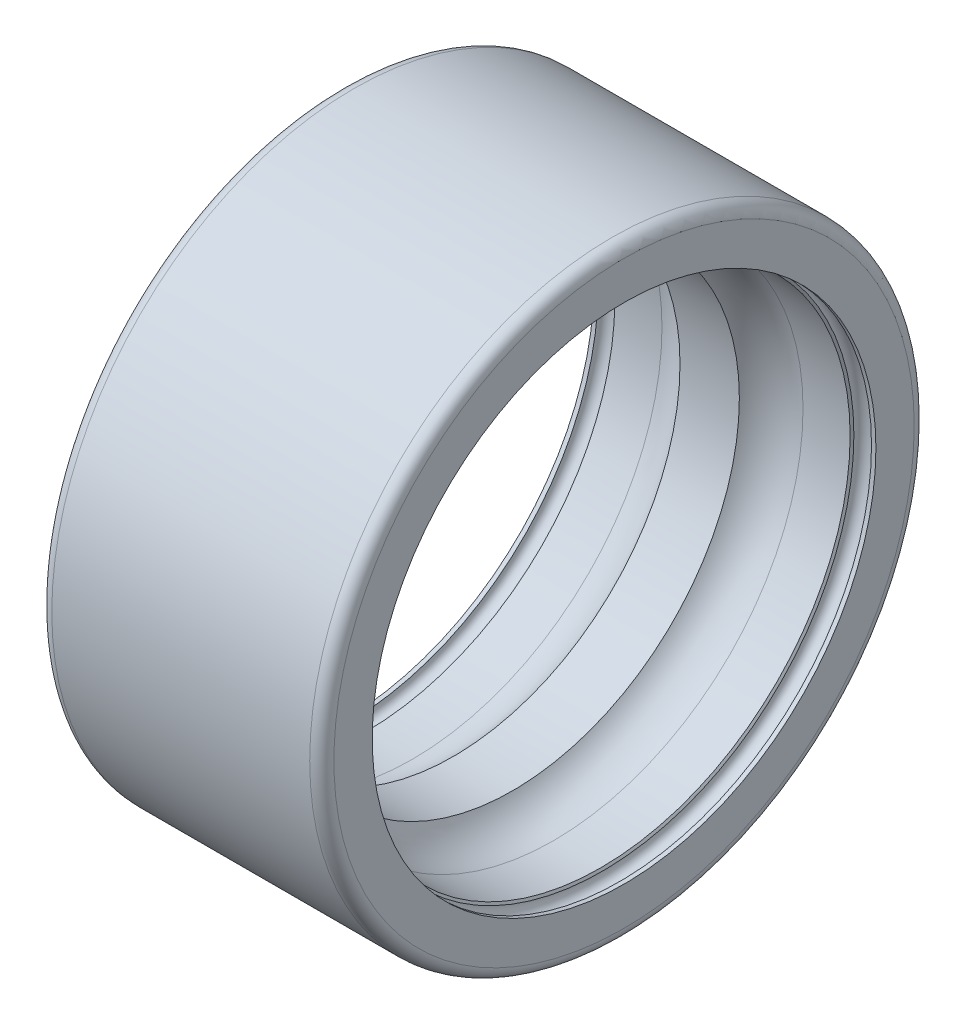
ISO-10303-21;
HEADER;
FILE_DESCRIPTION(('STEP AP214'),'2;1');
FILE_NAME('part.step','',(''),(''),'','','');
FILE_SCHEMA(('AUTOMOTIVE_DESIGN { 1 0 10303 214 1 1 1 1 }'));
ENDSEC;
DATA;
#1=APPLICATION_CONTEXT('core data for automotive mechanical design processes');
#2=APPLICATION_PROTOCOL_DEFINITION('international standard','automotive_design',2000,#1);
#3=PRODUCT_CONTEXT('',#1,'mechanical');
#4=PRODUCT('Part','Part','',(#3));
#5=PRODUCT_RELATED_PRODUCT_CATEGORY('part','',(#4));
#6=PRODUCT_DEFINITION_FORMATION('','',#4);
#7=PRODUCT_DEFINITION_CONTEXT('part definition',#1,'design');
#8=PRODUCT_DEFINITION('design','',#6,#7);
#9=PRODUCT_DEFINITION_SHAPE('','',#8);
#10=(LENGTH_UNIT() NAMED_UNIT(*) SI_UNIT(.MILLI.,.METRE.));
#11=(NAMED_UNIT(*) PLANE_ANGLE_UNIT() SI_UNIT($,.RADIAN.));
#12=(NAMED_UNIT(*) SI_UNIT($,.STERADIAN.) SOLID_ANGLE_UNIT());
#13=UNCERTAINTY_MEASURE_WITH_UNIT(LENGTH_MEASURE(1.E-05),#10,'distance_accuracy_value','');
#14=(GEOMETRIC_REPRESENTATION_CONTEXT(3) GLOBAL_UNCERTAINTY_ASSIGNED_CONTEXT((#13)) GLOBAL_UNIT_ASSIGNED_CONTEXT((#10,
#11,#12)) REPRESENTATION_CONTEXT('',''));
#15=CARTESIAN_POINT('',(0.,0.,0.));
#16=DIRECTION('',(0.,0.,1.));
#17=DIRECTION('',(1.,0.,0.));
#18=AXIS2_PLACEMENT_3D('',#15,#16,#17);
#19=CARTESIAN_POINT('',(0.,0.,-14.4));
#20=DIRECTION('',(-1.,0.,0.));
#21=DIRECTION('',(0.,0.,1.));
#22=AXIS2_PLACEMENT_3D('',#19,#20,#21);
#23=PLANE('',#22);
#24=CARTESIAN_POINT('',(0.,0.,0.));
#25=DIRECTION('',(1.,0.,0.));
#26=DIRECTION('',(0.,0.,-1.));
#27=AXIS2_PLACEMENT_3D('',#24,#25,#26);
#28=CIRCLE('',#27,12.5);
#29=CARTESIAN_POINT('',(0.,0.,-12.5));
#30=VERTEX_POINT('',#29);
#31=EDGE_CURVE('E81',#30,#30,#28,.T.);
#32=ORIENTED_EDGE('',*,*,#31,.T.);
#33=EDGE_LOOP('',(#32));
#34=FACE_BOUND('',#33,.T.);
#35=CARTESIAN_POINT('',(0.,0.,0.));
#36=DIRECTION('',(1.,0.,0.));
#37=DIRECTION('',(0.,0.,-1.));
#38=AXIS2_PLACEMENT_3D('',#35,#36,#37);
#39=CIRCLE('',#38,14.4);
#40=CARTESIAN_POINT('',(0.,0.,-14.4));
#41=VERTEX_POINT('',#40);
#42=EDGE_CURVE('E10',#41,#41,#39,.T.);
#43=ORIENTED_EDGE('',*,*,#42,.F.);
#44=EDGE_LOOP('',(#43));
#45=FACE_BOUND('',#44,.T.);
#46=ADVANCED_FACE('F29',(#34,#45),#23,.T.);
#47=CARTESIAN_POINT('',(0.599999999999874,0.,0.));
#48=DIRECTION('',(1.,0.,0.));
#49=DIRECTION('',(0.,0.,-1.));
#50=AXIS2_PLACEMENT_3D('',#47,#48,#49);
#51=TOROIDAL_SURFACE('',#50,14.4000000000001,0.599999999999874);
#52=ORIENTED_EDGE('',*,*,#42,.T.);
#53=EDGE_LOOP('',(#52));
#54=FACE_BOUND('',#53,.T.);
#55=CARTESIAN_POINT('',(0.6,0.,0.));
#56=DIRECTION('',(1.,0.,0.));
#57=DIRECTION('',(0.,0.,-1.));
#58=AXIS2_PLACEMENT_3D('',#55,#56,#57);
#59=CIRCLE('',#58,15.);
#60=CARTESIAN_POINT('',(0.6,0.,-15.));
#61=VERTEX_POINT('',#60);
#62=EDGE_CURVE('E35',#61,#61,#59,.T.);
#63=ORIENTED_EDGE('',*,*,#62,.F.);
#64=EDGE_LOOP('',(#63));
#65=FACE_BOUND('',#64,.T.);
#66=ADVANCED_FACE('F99',(#54,#65),#51,.T.);
#67=CARTESIAN_POINT('',(14.,0.,0.));
#68=DIRECTION('',(1.,0.,0.));
#69=DIRECTION('',(0.,0.,-1.));
#70=AXIS2_PLACEMENT_3D('',#67,#68,#69);
#71=CYLINDRICAL_SURFACE('',#70,15.);
#72=ORIENTED_EDGE('',*,*,#62,.T.);
#73=EDGE_LOOP('',(#72));
#74=FACE_BOUND('',#73,.T.);
#75=CARTESIAN_POINT('',(13.4,0.,0.));
#76=DIRECTION('',(1.,0.,0.));
#77=DIRECTION('',(0.,0.,-1.));
#78=AXIS2_PLACEMENT_3D('',#75,#76,#77);
#79=CIRCLE('',#78,15.);
#80=CARTESIAN_POINT('',(13.4,0.,-15.));
#81=VERTEX_POINT('',#80);
#82=EDGE_CURVE('E39',#81,#81,#79,.T.);
#83=ORIENTED_EDGE('',*,*,#82,.F.);
#84=EDGE_LOOP('',(#83));
#85=FACE_BOUND('',#84,.T.);
#86=ADVANCED_FACE('F103',(#74,#85),#71,.T.);
#87=CARTESIAN_POINT('',(13.4000000000002,0.,0.));
#88=DIRECTION('',(1.,0.,0.));
#89=DIRECTION('',(0.,0.,-1.));
#90=AXIS2_PLACEMENT_3D('',#87,#88,#89);
#91=TOROIDAL_SURFACE('',#90,14.4000000000002,0.599999999999755);
#92=ORIENTED_EDGE('',*,*,#82,.T.);
#93=EDGE_LOOP('',(#92));
#94=FACE_BOUND('',#93,.T.);
#95=CARTESIAN_POINT('',(14.,0.,0.));
#96=DIRECTION('',(1.,0.,0.));
#97=DIRECTION('',(0.,0.,-1.));
#98=AXIS2_PLACEMENT_3D('',#95,#96,#97);
#99=CIRCLE('',#98,14.4);
#100=CARTESIAN_POINT('',(14.,0.,-14.4));
#101=VERTEX_POINT('',#100);
#102=EDGE_CURVE('E43',#101,#101,#99,.T.);
#103=ORIENTED_EDGE('',*,*,#102,.F.);
#104=EDGE_LOOP('',(#103));
#105=FACE_BOUND('',#104,.T.);
#106=ADVANCED_FACE('F107',(#94,#105),#91,.T.);
#107=CARTESIAN_POINT('',(14.,0.,-12.5));
#108=DIRECTION('',(1.,0.,0.));
#109=DIRECTION('',(0.,0.,-1.));
#110=AXIS2_PLACEMENT_3D('',#107,#108,#109);
#111=PLANE('',#110);
#112=ORIENTED_EDGE('',*,*,#102,.T.);
#113=EDGE_LOOP('',(#112));
#114=FACE_BOUND('',#113,.T.);
#115=CARTESIAN_POINT('',(14.,0.,0.));
#116=DIRECTION('',(1.,0.,0.));
#117=DIRECTION('',(0.,0.,-1.));
#118=AXIS2_PLACEMENT_3D('',#115,#116,#117);
#119=CIRCLE('',#118,12.5);
#120=CARTESIAN_POINT('',(14.,0.,-12.5));
#121=VERTEX_POINT('',#120);
#122=EDGE_CURVE('E48',#121,#121,#119,.T.);
#123=ORIENTED_EDGE('',*,*,#122,.F.);
#124=EDGE_LOOP('',(#123));
#125=FACE_BOUND('',#124,.T.);
#126=ADVANCED_FACE('F113',(#114,#125),#111,.T.);
#127=CARTESIAN_POINT('',(14.,0.,0.));
#128=DIRECTION('',(1.,0.,0.));
#129=DIRECTION('',(0.,0.,-1.));
#130=AXIS2_PLACEMENT_3D('',#127,#128,#129);
#131=CYLINDRICAL_SURFACE('',#130,12.5);
#132=ORIENTED_EDGE('',*,*,#122,.T.);
#133=EDGE_LOOP('',(#132));
#134=FACE_BOUND('',#133,.T.);
#135=CARTESIAN_POINT('',(13.78125,0.,0.));
#136=DIRECTION('',(1.,0.,0.));
#137=DIRECTION('',(0.,0.,-1.));
#138=AXIS2_PLACEMENT_3D('',#135,#136,#137);
#139=CIRCLE('',#138,12.5);
#140=CARTESIAN_POINT('',(13.78125,0.,-12.5));
#141=VERTEX_POINT('',#140);
#142=EDGE_CURVE('E51',#141,#141,#139,.T.);
#143=ORIENTED_EDGE('',*,*,#142,.F.);
#144=EDGE_LOOP('',(#143));
#145=FACE_BOUND('',#144,.T.);
#146=ADVANCED_FACE('F117',(#134,#145),#131,.F.);
#147=CARTESIAN_POINT('',(13.34375,0.,0.));
#148=DIRECTION('',(1.,0.,0.));
#149=DIRECTION('',(0.,0.,-1.));
#150=AXIS2_PLACEMENT_3D('',#147,#148,#149);
#151=TOROIDAL_SURFACE('',#150,12.5,0.4375);
#152=ORIENTED_EDGE('',*,*,#142,.T.);
#153=EDGE_LOOP('',(#152));
#154=FACE_BOUND('',#153,.T.);
#155=CARTESIAN_POINT('',(12.90625,0.,0.));
#156=DIRECTION('',(1.,0.,0.));
#157=DIRECTION('',(0.,0.,-1.));
#158=AXIS2_PLACEMENT_3D('',#155,#156,#157);
#159=CIRCLE('',#158,12.5);
#160=CARTESIAN_POINT('',(12.90625,0.,-12.5));
#161=VERTEX_POINT('',#160);
#162=EDGE_CURVE('E54',#161,#161,#159,.T.);
#163=ORIENTED_EDGE('',*,*,#162,.F.);
#164=EDGE_LOOP('',(#163));
#165=FACE_BOUND('',#164,.T.);
#166=ADVANCED_FACE('F121',(#154,#165),#151,.F.);
#167=CARTESIAN_POINT('',(12.838122668236,0.,0.));
#168=DIRECTION('',(1.,0.,0.));
#169=DIRECTION('',(0.,0.,-1.));
#170=AXIS2_PLACEMENT_3D('',#167,#168,#169);
#171=CONICAL_SURFACE('',#170,12.382,1.04719755119899);
#172=ORIENTED_EDGE('',*,*,#162,.T.);
#173=EDGE_LOOP('',(#172));
#174=FACE_BOUND('',#173,.T.);
#175=CARTESIAN_POINT('',(12.838122668236,0.,0.));
#176=DIRECTION('',(1.,0.,0.));
#177=DIRECTION('',(0.,0.,-1.));
#178=AXIS2_PLACEMENT_3D('',#175,#176,#177);
#179=CIRCLE('',#178,12.382);
#180=CARTESIAN_POINT('',(12.838122668236,0.,-12.382));
#181=VERTEX_POINT('',#180);
#182=EDGE_CURVE('E57',#181,#181,#179,.T.);
#183=ORIENTED_EDGE('',*,*,#182,.F.);
#184=EDGE_LOOP('',(#183));
#185=FACE_BOUND('',#184,.T.);
#186=ADVANCED_FACE('F125',(#174,#185),#171,.F.);
#187=CARTESIAN_POINT('',(14.,0.,0.));
#188=DIRECTION('',(1.,0.,0.));
#189=DIRECTION('',(0.,0.,-1.));
#190=AXIS2_PLACEMENT_3D('',#187,#188,#189);
#191=CYLINDRICAL_SURFACE('',#190,12.382);
#192=ORIENTED_EDGE('',*,*,#182,.T.);
#193=EDGE_LOOP('',(#192));
#194=FACE_BOUND('',#193,.T.);
#195=CARTESIAN_POINT('',(10.5,0.,0.));
#196=DIRECTION('',(1.,0.,0.));
#197=DIRECTION('',(0.,0.,-1.));
#198=AXIS2_PLACEMENT_3D('',#195,#196,#197);
#199=CIRCLE('',#198,12.382);
#200=CARTESIAN_POINT('',(10.5,0.,-12.382));
#201=VERTEX_POINT('',#200);
#202=EDGE_CURVE('E60',#201,#201,#199,.T.);
#203=ORIENTED_EDGE('',*,*,#202,.F.);
#204=EDGE_LOOP('',(#203));
#205=FACE_BOUND('',#204,.T.);
#206=ADVANCED_FACE('F129',(#194,#205),#191,.F.);
#207=CARTESIAN_POINT('',(10.5000000000003,0.,0.));
#208=DIRECTION('',(1.,0.,0.));
#209=DIRECTION('',(0.,0.,-1.));
#210=AXIS2_PLACEMENT_3D('',#207,#208,#209);
#211=TOROIDAL_SURFACE('',#210,9.99999999999945,2.38200000000055);
#212=ORIENTED_EDGE('',*,*,#202,.T.);
#213=EDGE_LOOP('',(#212));
#214=FACE_BOUND('',#213,.T.);
#215=CARTESIAN_POINT('',(8.4723353334439,0.,0.));
#216=DIRECTION('',(1.,0.,0.));
#217=DIRECTION('',(0.,0.,-1.));
#218=AXIS2_PLACEMENT_3D('',#215,#216,#217);
#219=CIRCLE('',#218,11.25);
#220=CARTESIAN_POINT('',(8.4723353334439,0.,-11.25));
#221=VERTEX_POINT('',#220);
#222=EDGE_CURVE('E63',#221,#221,#219,.T.);
#223=ORIENTED_EDGE('',*,*,#222,.F.);
#224=EDGE_LOOP('',(#223));
#225=FACE_BOUND('',#224,.T.);
#226=ADVANCED_FACE('F133',(#214,#225),#211,.F.);
#227=CARTESIAN_POINT('',(14.,0.,0.));
#228=DIRECTION('',(1.,0.,0.));
#229=DIRECTION('',(0.,0.,-1.));
#230=AXIS2_PLACEMENT_3D('',#227,#228,#229);
#231=CYLINDRICAL_SURFACE('',#230,11.25);
#232=ORIENTED_EDGE('',*,*,#222,.T.);
#233=EDGE_LOOP('',(#232));
#234=FACE_BOUND('',#233,.T.);
#235=CARTESIAN_POINT('',(5.5276646665561,0.,0.));
#236=DIRECTION('',(1.,0.,0.));
#237=DIRECTION('',(0.,0.,-1.));
#238=AXIS2_PLACEMENT_3D('',#235,#236,#237);
#239=CIRCLE('',#238,11.25);
#240=CARTESIAN_POINT('',(5.5276646665561,0.,-11.25));
#241=VERTEX_POINT('',#240);
#242=EDGE_CURVE('E66',#241,#241,#239,.T.);
#243=ORIENTED_EDGE('',*,*,#242,.F.);
#244=EDGE_LOOP('',(#243));
#245=FACE_BOUND('',#244,.T.);
#246=ADVANCED_FACE('F137',(#234,#245),#231,.F.);
#247=CARTESIAN_POINT('',(3.49999999999971,0.,0.));
#248=DIRECTION('',(1.,0.,0.));
#249=DIRECTION('',(0.,0.,-1.));
#250=AXIS2_PLACEMENT_3D('',#247,#248,#249);
#251=TOROIDAL_SURFACE('',#250,9.99999999999945,2.38200000000055);
#252=ORIENTED_EDGE('',*,*,#242,.T.);
#253=EDGE_LOOP('',(#252));
#254=FACE_BOUND('',#253,.T.);
#255=CARTESIAN_POINT('',(3.5,0.,0.));
#256=DIRECTION('',(1.,0.,0.));
#257=DIRECTION('',(0.,0.,-1.));
#258=AXIS2_PLACEMENT_3D('',#255,#256,#257);
#259=CIRCLE('',#258,12.382);
#260=CARTESIAN_POINT('',(3.5,0.,-12.382));
#261=VERTEX_POINT('',#260);
#262=EDGE_CURVE('E69',#261,#261,#259,.T.);
#263=ORIENTED_EDGE('',*,*,#262,.F.);
#264=EDGE_LOOP('',(#263));
#265=FACE_BOUND('',#264,.T.);
#266=ADVANCED_FACE('F141',(#254,#265),#251,.F.);
#267=CARTESIAN_POINT('',(14.,0.,0.));
#268=DIRECTION('',(1.,0.,0.));
#269=DIRECTION('',(0.,0.,-1.));
#270=AXIS2_PLACEMENT_3D('',#267,#268,#269);
#271=CYLINDRICAL_SURFACE('',#270,12.382);
#272=ORIENTED_EDGE('',*,*,#262,.T.);
#273=EDGE_LOOP('',(#272));
#274=FACE_BOUND('',#273,.T.);
#275=CARTESIAN_POINT('',(1.1618773317644,0.,0.));
#276=DIRECTION('',(1.,0.,0.));
#277=DIRECTION('',(0.,0.,-1.));
#278=AXIS2_PLACEMENT_3D('',#275,#276,#277);
#279=CIRCLE('',#278,12.382);
#280=CARTESIAN_POINT('',(1.1618773317644,0.,-12.382));
#281=VERTEX_POINT('',#280);
#282=EDGE_CURVE('E72',#281,#281,#279,.T.);
#283=ORIENTED_EDGE('',*,*,#282,.F.);
#284=EDGE_LOOP('',(#283));
#285=FACE_BOUND('',#284,.T.);
#286=ADVANCED_FACE('F145',(#274,#285),#271,.F.);
#287=CARTESIAN_POINT('',(1.09375,0.,0.));
#288=DIRECTION('',(-1.,0.,0.));
#289=DIRECTION('',(0.,0.,1.));
#290=AXIS2_PLACEMENT_3D('',#287,#288,#289);
#291=CONICAL_SURFACE('',#290,12.5,1.04719755119644);
#292=ORIENTED_EDGE('',*,*,#282,.T.);
#293=EDGE_LOOP('',(#292));
#294=FACE_BOUND('',#293,.T.);
#295=CARTESIAN_POINT('',(1.09375,0.,0.));
#296=DIRECTION('',(1.,0.,0.));
#297=DIRECTION('',(0.,0.,-1.));
#298=AXIS2_PLACEMENT_3D('',#295,#296,#297);
#299=CIRCLE('',#298,12.5);
#300=CARTESIAN_POINT('',(1.09375,0.,-12.5));
#301=VERTEX_POINT('',#300);
#302=EDGE_CURVE('E75',#301,#301,#299,.T.);
#303=ORIENTED_EDGE('',*,*,#302,.F.);
#304=EDGE_LOOP('',(#303));
#305=FACE_BOUND('',#304,.T.);
#306=ADVANCED_FACE('F95',(#294,#305),#291,.F.);
#307=CARTESIAN_POINT('',(0.65625,0.,0.));
#308=DIRECTION('',(1.,0.,0.));
#309=DIRECTION('',(0.,0.,-1.));
#310=AXIS2_PLACEMENT_3D('',#307,#308,#309);
#311=TOROIDAL_SURFACE('',#310,12.5,0.4375);
#312=ORIENTED_EDGE('',*,*,#302,.T.);
#313=EDGE_LOOP('',(#312));
#314=FACE_BOUND('',#313,.T.);
#315=CARTESIAN_POINT('',(0.21875,0.,0.));
#316=DIRECTION('',(1.,0.,0.));
#317=DIRECTION('',(0.,0.,-1.));
#318=AXIS2_PLACEMENT_3D('',#315,#316,#317);
#319=CIRCLE('',#318,12.5);
#320=CARTESIAN_POINT('',(0.21875,0.,-12.5));
#321=VERTEX_POINT('',#320);
#322=EDGE_CURVE('E78',#321,#321,#319,.T.);
#323=ORIENTED_EDGE('',*,*,#322,.F.);
#324=EDGE_LOOP('',(#323));
#325=FACE_BOUND('',#324,.T.);
#326=ADVANCED_FACE('F89',(#314,#325),#311,.F.);
#327=CARTESIAN_POINT('',(14.,0.,0.));
#328=DIRECTION('',(1.,0.,0.));
#329=DIRECTION('',(0.,0.,-1.));
#330=AXIS2_PLACEMENT_3D('',#327,#328,#329);
#331=CYLINDRICAL_SURFACE('',#330,12.5);
#332=ORIENTED_EDGE('',*,*,#322,.T.);
#333=EDGE_LOOP('',(#332));
#334=FACE_BOUND('',#333,.T.);
#335=ORIENTED_EDGE('',*,*,#31,.F.);
#336=EDGE_LOOP('',(#335));
#337=FACE_BOUND('',#336,.T.);
#338=ADVANCED_FACE('F87',(#334,#337),#331,.F.);
#339=CLOSED_SHELL('',(#46,#66,#86,#106,#126,#146,#166,#186,#206,#226,#246,#266,#286,#306,#326,#338));
#340=MANIFOLD_SOLID_BREP('B2',#339);
#341=ADVANCED_BREP_SHAPE_REPRESENTATION('',(#18,#340),#14);
#342=SHAPE_DEFINITION_REPRESENTATION(#9,#341);
ENDSEC;
END-ISO-10303-21;
